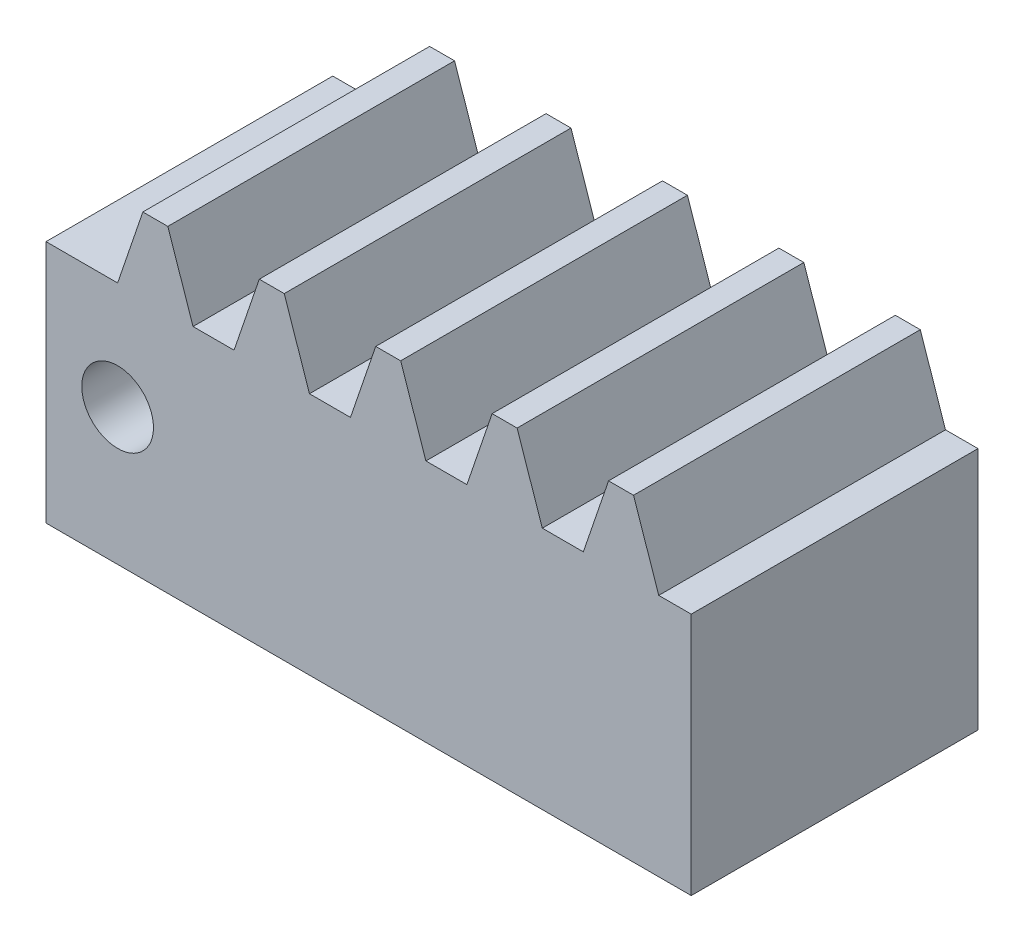
ISO-10303-21;
HEADER;
FILE_DESCRIPTION(('STEP AP214'),'2;1');
FILE_NAME('part.step','',(''),(''),'','','');
FILE_SCHEMA(('AUTOMOTIVE_DESIGN { 1 0 10303 214 1 1 1 1 }'));
ENDSEC;
DATA;
#1=APPLICATION_CONTEXT('core data for automotive mechanical design processes');
#2=APPLICATION_PROTOCOL_DEFINITION('international standard','automotive_design',2000,#1);
#3=PRODUCT_CONTEXT('',#1,'mechanical');
#4=PRODUCT('Part','Part','',(#3));
#5=PRODUCT_RELATED_PRODUCT_CATEGORY('part','',(#4));
#6=PRODUCT_DEFINITION_FORMATION('','',#4);
#7=PRODUCT_DEFINITION_CONTEXT('part definition',#1,'design');
#8=PRODUCT_DEFINITION('design','',#6,#7);
#9=PRODUCT_DEFINITION_SHAPE('','',#8);
#10=(LENGTH_UNIT() NAMED_UNIT(*) SI_UNIT(.MILLI.,.METRE.));
#11=(NAMED_UNIT(*) PLANE_ANGLE_UNIT() SI_UNIT($,.RADIAN.));
#12=(NAMED_UNIT(*) SI_UNIT($,.STERADIAN.) SOLID_ANGLE_UNIT());
#13=UNCERTAINTY_MEASURE_WITH_UNIT(LENGTH_MEASURE(1.E-05),#10,'distance_accuracy_value','');
#14=(GEOMETRIC_REPRESENTATION_CONTEXT(3) GLOBAL_UNCERTAINTY_ASSIGNED_CONTEXT((#13)) GLOBAL_UNIT_ASSIGNED_CONTEXT((#10,
#11,#12)) REPRESENTATION_CONTEXT('',''));
#15=CARTESIAN_POINT('',(0.,0.,0.));
#16=DIRECTION('',(0.,0.,1.));
#17=DIRECTION('',(1.,0.,0.));
#18=AXIS2_PLACEMENT_3D('',#15,#16,#17);
#19=CARTESIAN_POINT('',(0.,0.,25.4));
#20=DIRECTION('',(0.,1.,0.));
#21=DIRECTION('',(0.,0.,1.));
#22=AXIS2_PLACEMENT_3D('',#19,#20,#21);
#23=PLANE('',#22);
#24=DIRECTION('',(1.,0.,0.));
#25=VECTOR('',#24,1.);
#26=CARTESIAN_POINT('',(0.,0.,0.));
#27=LINE('',#26,#25);
#28=CARTESIAN_POINT('',(6.35,0.,0.));
#29=VERTEX_POINT('',#28);
#30=CARTESIAN_POINT('',(63.5,0.,0.));
#31=VERTEX_POINT('',#30);
#32=EDGE_CURVE('E274',#29,#31,#27,.T.);
#33=ORIENTED_EDGE('',*,*,#32,.T.);
#34=DIRECTION('',(0.,0.,-1.));
#35=VECTOR('',#34,1.);
#36=CARTESIAN_POINT('',(63.5,0.,25.4));
#37=LINE('',#36,#35);
#38=CARTESIAN_POINT('',(63.5,0.,25.4));
#39=VERTEX_POINT('',#38);
#40=EDGE_CURVE('E11',#39,#31,#37,.T.);
#41=ORIENTED_EDGE('',*,*,#40,.F.);
#42=DIRECTION('',(1.,0.,0.));
#43=VECTOR('',#42,1.);
#44=CARTESIAN_POINT('',(0.,0.,25.4));
#45=LINE('',#44,#43);
#46=CARTESIAN_POINT('',(6.35,0.,25.4));
#47=VERTEX_POINT('',#46);
#48=EDGE_CURVE('E240',#47,#39,#45,.T.);
#49=ORIENTED_EDGE('',*,*,#48,.F.);
#50=DIRECTION('',(0.,0.,-1.));
#51=VECTOR('',#50,1.);
#52=CARTESIAN_POINT('',(6.35,0.,25.4));
#53=LINE('',#52,#51);
#54=EDGE_CURVE('E228',#47,#29,#53,.T.);
#55=ORIENTED_EDGE('',*,*,#54,.T.);
#56=EDGE_LOOP('',(#33,#41,#49,#55));
#57=FACE_BOUND('',#56,.T.);
#58=ADVANCED_FACE('F37',(#57),#23,.F.);
#59=CARTESIAN_POINT('',(63.5,0.,25.4));
#60=DIRECTION('',(-1.,0.,0.));
#61=DIRECTION('',(0.,0.,1.));
#62=AXIS2_PLACEMENT_3D('',#59,#60,#61);
#63=PLANE('',#62);
#64=DIRECTION('',(0.,1.,0.));
#65=VECTOR('',#64,1.);
#66=CARTESIAN_POINT('',(63.5,0.,0.));
#67=LINE('',#66,#65);
#68=CARTESIAN_POINT('',(63.5,21.59,0.));
#69=VERTEX_POINT('',#68);
#70=EDGE_CURVE('E277',#31,#69,#67,.T.);
#71=ORIENTED_EDGE('',*,*,#70,.T.);
#72=DIRECTION('',(0.,0.,-1.));
#73=VECTOR('',#72,1.);
#74=CARTESIAN_POINT('',(63.5,21.59,25.4));
#75=LINE('',#74,#73);
#76=CARTESIAN_POINT('',(63.5,21.59,25.4));
#77=VERTEX_POINT('',#76);
#78=EDGE_CURVE('E46',#77,#69,#75,.T.);
#79=ORIENTED_EDGE('',*,*,#78,.F.);
#80=DIRECTION('',(0.,1.,0.));
#81=VECTOR('',#80,1.);
#82=CARTESIAN_POINT('',(63.5,0.,25.4));
#83=LINE('',#82,#81);
#84=EDGE_CURVE('E145',#39,#77,#83,.T.);
#85=ORIENTED_EDGE('',*,*,#84,.F.);
#86=ORIENTED_EDGE('',*,*,#40,.T.);
#87=EDGE_LOOP('',(#71,#79,#85,#86));
#88=FACE_BOUND('',#87,.T.);
#89=ADVANCED_FACE('F470',(#88),#63,.F.);
#90=CARTESIAN_POINT('',(0.,21.59,25.4));
#91=DIRECTION('',(0.,-1.,0.));
#92=DIRECTION('',(0.,0.,-1.));
#93=AXIS2_PLACEMENT_3D('',#90,#91,#92);
#94=PLANE('',#93);
#95=DIRECTION('',(-1.,0.,0.));
#96=VECTOR('',#95,1.);
#97=CARTESIAN_POINT('',(0.,21.59,0.));
#98=LINE('',#97,#96);
#99=CARTESIAN_POINT('',(60.6232101286471,21.59,0.));
#100=VERTEX_POINT('',#99);
#101=EDGE_CURVE('E279',#69,#100,#98,.T.);
#102=ORIENTED_EDGE('',*,*,#101,.T.);
#103=DIRECTION('',(0.,0.,-1.));
#104=VECTOR('',#103,1.);
#105=CARTESIAN_POINT('',(60.6232101286471,21.59,25.4));
#106=LINE('',#105,#104);
#107=CARTESIAN_POINT('',(60.6232101286471,21.59,25.4));
#108=VERTEX_POINT('',#107);
#109=EDGE_CURVE('E370',#108,#100,#106,.T.);
#110=ORIENTED_EDGE('',*,*,#109,.F.);
#111=DIRECTION('',(-1.,0.,0.));
#112=VECTOR('',#111,1.);
#113=CARTESIAN_POINT('',(0.,21.59,25.4));
#114=LINE('',#113,#112);
#115=EDGE_CURVE('E227',#77,#108,#114,.T.);
#116=ORIENTED_EDGE('',*,*,#115,.F.);
#117=ORIENTED_EDGE('',*,*,#78,.T.);
#118=EDGE_LOOP('',(#102,#110,#116,#117));
#119=FACE_BOUND('',#118,.T.);
#120=ADVANCED_FACE('F375',(#119),#94,.F.);
#121=CARTESIAN_POINT('',(60.9123049435169,20.7409837863864,25.4));
#122=DIRECTION('',(-0.946626767394288,-0.322331759609009,0.));
#123=DIRECTION('',(0.322331759609009,-0.946626767394288,0.));
#124=AXIS2_PLACEMENT_3D('',#121,#122,#123);
#125=PLANE('',#124);
#126=DIRECTION('',(-0.322331759609009,0.946626767394288,0.));
#127=VECTOR('',#126,1.);
#128=CARTESIAN_POINT('',(60.9123049435169,20.7409837863864,0.));
#129=LINE('',#128,#127);
#130=CARTESIAN_POINT('',(58.3880101286471,28.1543551632837,0.));
#131=VERTEX_POINT('',#130);
#132=EDGE_CURVE('E281',#100,#131,#129,.T.);
#133=ORIENTED_EDGE('',*,*,#132,.T.);
#134=DIRECTION('',(0.,0.,-1.));
#135=VECTOR('',#134,1.);
#136=CARTESIAN_POINT('',(58.3880101286471,28.1543551632837,25.4));
#137=LINE('',#136,#135);
#138=CARTESIAN_POINT('',(58.3880101286471,28.1543551632837,25.4));
#139=VERTEX_POINT('',#138);
#140=EDGE_CURVE('E367',#139,#131,#137,.T.);
#141=ORIENTED_EDGE('',*,*,#140,.F.);
#142=DIRECTION('',(-0.322331759609009,0.946626767394288,0.));
#143=VECTOR('',#142,1.);
#144=CARTESIAN_POINT('',(60.9123049435169,20.7409837863864,25.4));
#145=LINE('',#144,#143);
#146=EDGE_CURVE('E235',#108,#139,#145,.T.);
#147=ORIENTED_EDGE('',*,*,#146,.F.);
#148=ORIENTED_EDGE('',*,*,#109,.T.);
#149=EDGE_LOOP('',(#133,#141,#147,#148));
#150=FACE_BOUND('',#149,.T.);
#151=ADVANCED_FACE('F384',(#150),#125,.F.);
#152=CARTESIAN_POINT('',(0.,28.1543551632837,25.4));
#153=DIRECTION('',(0.,-1.,0.));
#154=DIRECTION('',(0.,0.,-1.));
#155=AXIS2_PLACEMENT_3D('',#152,#153,#154);
#156=PLANE('',#155);
#157=DIRECTION('',(-1.,0.,0.));
#158=VECTOR('',#157,1.);
#159=CARTESIAN_POINT('',(0.,28.1543551632837,0.));
#160=LINE('',#159,#158);
#161=CARTESIAN_POINT('',(56.1782101286471,28.1543551632837,0.));
#162=VERTEX_POINT('',#161);
#163=EDGE_CURVE('E284',#131,#162,#160,.T.);
#164=ORIENTED_EDGE('',*,*,#163,.T.);
#165=DIRECTION('',(0.,0.,-1.));
#166=VECTOR('',#165,1.);
#167=CARTESIAN_POINT('',(56.1782101286471,28.1543551632837,25.4));
#168=LINE('',#167,#166);
#169=CARTESIAN_POINT('',(56.1782101286471,28.1543551632837,25.4));
#170=VERTEX_POINT('',#169);
#171=EDGE_CURVE('E364',#170,#162,#168,.T.);
#172=ORIENTED_EDGE('',*,*,#171,.F.);
#173=DIRECTION('',(-1.,0.,0.));
#174=VECTOR('',#173,1.);
#175=CARTESIAN_POINT('',(0.,28.1543551632837,25.4));
#176=LINE('',#175,#174);
#177=EDGE_CURVE('E239',#139,#170,#176,.T.);
#178=ORIENTED_EDGE('',*,*,#177,.F.);
#179=ORIENTED_EDGE('',*,*,#140,.T.);
#180=EDGE_LOOP('',(#164,#172,#178,#179));
#181=FACE_BOUND('',#180,.T.);
#182=ADVANCED_FACE('F388',(#181),#156,.F.);
#183=CARTESIAN_POINT('',(41.7507412847351,-14.2163631610935,25.4));
#184=DIRECTION('',(0.946626767394288,-0.322331759609009,0.));
#185=DIRECTION('',(0.322331759609009,0.946626767394288,0.));
#186=AXIS2_PLACEMENT_3D('',#183,#184,#185);
#187=PLANE('',#186);
#188=DIRECTION('',(-0.322331759609009,-0.946626767394288,0.));
#189=VECTOR('',#188,1.);
#190=CARTESIAN_POINT('',(41.7507412847351,-14.2163631610935,0.));
#191=LINE('',#190,#189);
#192=CARTESIAN_POINT('',(53.9430101286471,21.59,0.));
#193=VERTEX_POINT('',#192);
#194=EDGE_CURVE('E286',#162,#193,#191,.T.);
#195=ORIENTED_EDGE('',*,*,#194,.T.);
#196=DIRECTION('',(0.,0.,-1.));
#197=VECTOR('',#196,1.);
#198=CARTESIAN_POINT('',(53.9430101286471,21.59,25.4));
#199=LINE('',#198,#197);
#200=CARTESIAN_POINT('',(53.9430101286471,21.59,25.4));
#201=VERTEX_POINT('',#200);
#202=EDGE_CURVE('E361',#201,#193,#199,.T.);
#203=ORIENTED_EDGE('',*,*,#202,.F.);
#204=DIRECTION('',(-0.322331759609009,-0.946626767394288,0.));
#205=VECTOR('',#204,1.);
#206=CARTESIAN_POINT('',(41.7507412847351,-14.2163631610935,25.4));
#207=LINE('',#206,#205);
#208=EDGE_CURVE('E242',#170,#201,#207,.T.);
#209=ORIENTED_EDGE('',*,*,#208,.F.);
#210=ORIENTED_EDGE('',*,*,#171,.T.);
#211=EDGE_LOOP('',(#195,#203,#209,#210));
#212=FACE_BOUND('',#211,.T.);
#213=ADVANCED_FACE('F466',(#212),#187,.F.);
#214=CARTESIAN_POINT('',(50.3108101286471,21.59,0.));
#215=VERTEX_POINT('',#214);
#216=EDGE_CURVE('E282',#193,#215,#98,.T.);
#217=ORIENTED_EDGE('',*,*,#216,.T.);
#218=DIRECTION('',(0.,0.,-1.));
#219=VECTOR('',#218,1.);
#220=CARTESIAN_POINT('',(50.3108101286471,21.59,25.4));
#221=LINE('',#220,#219);
#222=CARTESIAN_POINT('',(50.3108101286471,21.59,25.4));
#223=VERTEX_POINT('',#222);
#224=EDGE_CURVE('E358',#223,#215,#221,.T.);
#225=ORIENTED_EDGE('',*,*,#224,.F.);
#226=EDGE_CURVE('E236',#201,#223,#114,.T.);
#227=ORIENTED_EDGE('',*,*,#226,.F.);
#228=ORIENTED_EDGE('',*,*,#202,.T.);
#229=EDGE_LOOP('',(#217,#225,#227,#228));
#230=FACE_BOUND('',#229,.T.);
#231=ADVANCED_FACE('F454',(#230),#94,.F.);
#232=CARTESIAN_POINT('',(51.6713402372834,17.5943831230182,25.4));
#233=DIRECTION('',(-0.946626767394288,-0.322331759609009,0.));
#234=DIRECTION('',(0.322331759609009,-0.946626767394288,0.));
#235=AXIS2_PLACEMENT_3D('',#232,#233,#234);
#236=PLANE('',#235);
#237=DIRECTION('',(-0.322331759609009,0.946626767394288,0.));
#238=VECTOR('',#237,1.);
#239=CARTESIAN_POINT('',(51.6713402372834,17.5943831230182,0.));
#240=LINE('',#239,#238);
#241=CARTESIAN_POINT('',(48.0756101286471,28.1543551632837,0.));
#242=VERTEX_POINT('',#241);
#243=EDGE_CURVE('E288',#215,#242,#240,.T.);
#244=ORIENTED_EDGE('',*,*,#243,.T.);
#245=DIRECTION('',(0.,0.,-1.));
#246=VECTOR('',#245,1.);
#247=CARTESIAN_POINT('',(48.0756101286471,28.1543551632837,25.4));
#248=LINE('',#247,#246);
#249=CARTESIAN_POINT('',(48.0756101286471,28.1543551632837,25.4));
#250=VERTEX_POINT('',#249);
#251=EDGE_CURVE('E355',#250,#242,#248,.T.);
#252=ORIENTED_EDGE('',*,*,#251,.F.);
#253=DIRECTION('',(-0.322331759609009,0.946626767394288,0.));
#254=VECTOR('',#253,1.);
#255=CARTESIAN_POINT('',(51.6713402372834,17.5943831230182,25.4));
#256=LINE('',#255,#254);
#257=EDGE_CURVE('E241',#223,#250,#256,.T.);
#258=ORIENTED_EDGE('',*,*,#257,.F.);
#259=ORIENTED_EDGE('',*,*,#224,.T.);
#260=EDGE_LOOP('',(#244,#252,#258,#259));
#261=FACE_BOUND('',#260,.T.);
#262=ADVANCED_FACE('F458',(#261),#236,.F.);
#263=CARTESIAN_POINT('',(0.,28.1543551632837,25.4));
#264=DIRECTION('',(0.,-1.,0.));
#265=DIRECTION('',(0.,0.,-1.));
#266=AXIS2_PLACEMENT_3D('',#263,#264,#265);
#267=PLANE('',#266);
#268=DIRECTION('',(-1.,0.,0.));
#269=VECTOR('',#268,1.);
#270=CARTESIAN_POINT('',(0.,28.1543551632837,0.));
#271=LINE('',#270,#269);
#272=CARTESIAN_POINT('',(45.8658101286471,28.1543551632837,0.));
#273=VERTEX_POINT('',#272);
#274=EDGE_CURVE('E290',#242,#273,#271,.T.);
#275=ORIENTED_EDGE('',*,*,#274,.T.);
#276=DIRECTION('',(0.,0.,-1.));
#277=VECTOR('',#276,1.);
#278=CARTESIAN_POINT('',(45.8658101286471,28.1543551632837,25.4));
#279=LINE('',#278,#277);
#280=CARTESIAN_POINT('',(45.8658101286471,28.1543551632837,25.4));
#281=VERTEX_POINT('',#280);
#282=EDGE_CURVE('E352',#281,#273,#279,.T.);
#283=ORIENTED_EDGE('',*,*,#282,.F.);
#284=DIRECTION('',(-1.,0.,0.));
#285=VECTOR('',#284,1.);
#286=CARTESIAN_POINT('',(0.,28.1543551632837,25.4));
#287=LINE('',#286,#285);
#288=EDGE_CURVE('E246',#250,#281,#287,.T.);
#289=ORIENTED_EDGE('',*,*,#288,.F.);
#290=ORIENTED_EDGE('',*,*,#251,.T.);
#291=EDGE_LOOP('',(#275,#283,#289,#290));
#292=FACE_BOUND('',#291,.T.);
#293=ADVANCED_FACE('F400',(#292),#267,.F.);
#294=CARTESIAN_POINT('',(32.5097765785017,-11.0697624977253,25.4));
#295=DIRECTION('',(0.946626767394288,-0.322331759609009,0.));
#296=DIRECTION('',(0.322331759609009,0.946626767394288,0.));
#297=AXIS2_PLACEMENT_3D('',#294,#295,#296);
#298=PLANE('',#297);
#299=DIRECTION('',(-0.322331759609009,-0.946626767394288,0.));
#300=VECTOR('',#299,1.);
#301=CARTESIAN_POINT('',(32.5097765785017,-11.0697624977253,0.));
#302=LINE('',#301,#300);
#303=CARTESIAN_POINT('',(43.6306101286471,21.59,0.));
#304=VERTEX_POINT('',#303);
#305=EDGE_CURVE('E292',#273,#304,#302,.T.);
#306=ORIENTED_EDGE('',*,*,#305,.T.);
#307=DIRECTION('',(0.,0.,-1.));
#308=VECTOR('',#307,1.);
#309=CARTESIAN_POINT('',(43.6306101286471,21.59,25.4));
#310=LINE('',#309,#308);
#311=CARTESIAN_POINT('',(43.6306101286471,21.59,25.4));
#312=VERTEX_POINT('',#311);
#313=EDGE_CURVE('E349',#312,#304,#310,.T.);
#314=ORIENTED_EDGE('',*,*,#313,.F.);
#315=DIRECTION('',(-0.322331759609009,-0.946626767394288,0.));
#316=VECTOR('',#315,1.);
#317=CARTESIAN_POINT('',(32.5097765785017,-11.0697624977253,25.4));
#318=LINE('',#317,#316);
#319=EDGE_CURVE('E250',#281,#312,#318,.T.);
#320=ORIENTED_EDGE('',*,*,#319,.F.);
#321=ORIENTED_EDGE('',*,*,#282,.T.);
#322=EDGE_LOOP('',(#306,#314,#320,#321));
#323=FACE_BOUND('',#322,.T.);
#324=ADVANCED_FACE('F404',(#323),#298,.F.);
#325=CARTESIAN_POINT('',(39.9984101286471,21.59,0.));
#326=VERTEX_POINT('',#325);
#327=EDGE_CURVE('E294',#304,#326,#98,.T.);
#328=ORIENTED_EDGE('',*,*,#327,.T.);
#329=DIRECTION('',(0.,0.,-1.));
#330=VECTOR('',#329,1.);
#331=CARTESIAN_POINT('',(39.9984101286471,21.59,25.4));
#332=LINE('',#331,#330);
#333=CARTESIAN_POINT('',(39.9984101286471,21.59,25.4));
#334=VERTEX_POINT('',#333);
#335=EDGE_CURVE('E346',#334,#326,#332,.T.);
#336=ORIENTED_EDGE('',*,*,#335,.F.);
#337=EDGE_CURVE('E243',#312,#334,#114,.T.);
#338=ORIENTED_EDGE('',*,*,#337,.F.);
#339=ORIENTED_EDGE('',*,*,#313,.T.);
#340=EDGE_LOOP('',(#328,#336,#338,#339));
#341=FACE_BOUND('',#340,.T.);
#342=ADVANCED_FACE('F407',(#341),#94,.F.);
#343=CARTESIAN_POINT('',(42.4303755310499,14.4477824596499,25.4));
#344=DIRECTION('',(-0.946626767394289,-0.322331759609008,0.));
#345=DIRECTION('',(0.322331759609008,-0.946626767394289,0.));
#346=AXIS2_PLACEMENT_3D('',#343,#344,#345);
#347=PLANE('',#346);
#348=DIRECTION('',(-0.322331759609008,0.946626767394289,0.));
#349=VECTOR('',#348,1.);
#350=CARTESIAN_POINT('',(42.4303755310499,14.4477824596499,0.));
#351=LINE('',#350,#349);
#352=CARTESIAN_POINT('',(37.7632101286471,28.1543551632837,0.));
#353=VERTEX_POINT('',#352);
#354=EDGE_CURVE('E295',#326,#353,#351,.T.);
#355=ORIENTED_EDGE('',*,*,#354,.T.);
#356=DIRECTION('',(0.,0.,-1.));
#357=VECTOR('',#356,1.);
#358=CARTESIAN_POINT('',(37.7632101286471,28.1543551632837,25.4));
#359=LINE('',#358,#357);
#360=CARTESIAN_POINT('',(37.7632101286471,28.1543551632837,25.4));
#361=VERTEX_POINT('',#360);
#362=EDGE_CURVE('E343',#361,#353,#359,.T.);
#363=ORIENTED_EDGE('',*,*,#362,.F.);
#364=DIRECTION('',(-0.322331759609008,0.946626767394289,0.));
#365=VECTOR('',#364,1.);
#366=CARTESIAN_POINT('',(42.4303755310499,14.4477824596499,25.4));
#367=LINE('',#366,#365);
#368=EDGE_CURVE('E249',#334,#361,#367,.T.);
#369=ORIENTED_EDGE('',*,*,#368,.F.);
#370=ORIENTED_EDGE('',*,*,#335,.T.);
#371=EDGE_LOOP('',(#355,#363,#369,#370));
#372=FACE_BOUND('',#371,.T.);
#373=ADVANCED_FACE('F412',(#372),#347,.F.);
#374=CARTESIAN_POINT('',(0.,28.1543551632837,25.4));
#375=DIRECTION('',(0.,-1.,0.));
#376=DIRECTION('',(0.,0.,-1.));
#377=AXIS2_PLACEMENT_3D('',#374,#375,#376);
#378=PLANE('',#377);
#379=DIRECTION('',(-1.,0.,0.));
#380=VECTOR('',#379,1.);
#381=CARTESIAN_POINT('',(0.,28.1543551632837,0.));
#382=LINE('',#381,#380);
#383=CARTESIAN_POINT('',(35.5534101286471,28.1543551632837,0.));
#384=VERTEX_POINT('',#383);
#385=EDGE_CURVE('E297',#353,#384,#382,.T.);
#386=ORIENTED_EDGE('',*,*,#385,.T.);
#387=DIRECTION('',(0.,0.,-1.));
#388=VECTOR('',#387,1.);
#389=CARTESIAN_POINT('',(35.5534101286471,28.1543551632837,25.4));
#390=LINE('',#389,#388);
#391=CARTESIAN_POINT('',(35.5534101286471,28.1543551632837,25.4));
#392=VERTEX_POINT('',#391);
#393=EDGE_CURVE('E340',#392,#384,#390,.T.);
#394=ORIENTED_EDGE('',*,*,#393,.F.);
#395=DIRECTION('',(-1.,0.,0.));
#396=VECTOR('',#395,1.);
#397=CARTESIAN_POINT('',(0.,28.1543551632837,25.4));
#398=LINE('',#397,#396);
#399=EDGE_CURVE('E253',#361,#392,#398,.T.);
#400=ORIENTED_EDGE('',*,*,#399,.F.);
#401=ORIENTED_EDGE('',*,*,#362,.T.);
#402=EDGE_LOOP('',(#386,#394,#400,#401));
#403=FACE_BOUND('',#402,.T.);
#404=ADVANCED_FACE('F416',(#403),#378,.F.);
#405=CARTESIAN_POINT('',(23.2688118722682,-7.92316183435702,25.4));
#406=DIRECTION('',(0.946626767394289,-0.322331759609008,0.));
#407=DIRECTION('',(0.322331759609008,0.946626767394289,0.));
#408=AXIS2_PLACEMENT_3D('',#405,#406,#407);
#409=PLANE('',#408);
#410=DIRECTION('',(-0.322331759609008,-0.946626767394289,0.));
#411=VECTOR('',#410,1.);
#412=CARTESIAN_POINT('',(23.2688118722682,-7.92316183435702,0.));
#413=LINE('',#412,#411);
#414=CARTESIAN_POINT('',(33.3182101286471,21.59,0.));
#415=VERTEX_POINT('',#414);
#416=EDGE_CURVE('E299',#384,#415,#413,.T.);
#417=ORIENTED_EDGE('',*,*,#416,.T.);
#418=DIRECTION('',(0.,0.,-1.));
#419=VECTOR('',#418,1.);
#420=CARTESIAN_POINT('',(33.3182101286471,21.59,25.4));
#421=LINE('',#420,#419);
#422=CARTESIAN_POINT('',(33.3182101286471,21.59,25.4));
#423=VERTEX_POINT('',#422);
#424=EDGE_CURVE('E337',#423,#415,#421,.T.);
#425=ORIENTED_EDGE('',*,*,#424,.F.);
#426=DIRECTION('',(-0.322331759609008,-0.946626767394289,0.));
#427=VECTOR('',#426,1.);
#428=CARTESIAN_POINT('',(23.2688118722682,-7.92316183435702,25.4));
#429=LINE('',#428,#427);
#430=EDGE_CURVE('E257',#392,#423,#429,.T.);
#431=ORIENTED_EDGE('',*,*,#430,.F.);
#432=ORIENTED_EDGE('',*,*,#393,.T.);
#433=EDGE_LOOP('',(#417,#425,#431,#432));
#434=FACE_BOUND('',#433,.T.);
#435=ADVANCED_FACE('F420',(#434),#409,.F.);
#436=CARTESIAN_POINT('',(29.6860101286471,21.59,0.));
#437=VERTEX_POINT('',#436);
#438=EDGE_CURVE('E301',#415,#437,#98,.T.);
#439=ORIENTED_EDGE('',*,*,#438,.T.);
#440=DIRECTION('',(0.,0.,-1.));
#441=VECTOR('',#440,1.);
#442=CARTESIAN_POINT('',(29.6860101286471,21.59,25.4));
#443=LINE('',#442,#441);
#444=CARTESIAN_POINT('',(29.6860101286471,21.59,25.4));
#445=VERTEX_POINT('',#444);
#446=EDGE_CURVE('E334',#445,#437,#443,.T.);
#447=ORIENTED_EDGE('',*,*,#446,.F.);
#448=EDGE_CURVE('E234',#423,#445,#114,.T.);
#449=ORIENTED_EDGE('',*,*,#448,.F.);
#450=ORIENTED_EDGE('',*,*,#424,.T.);
#451=EDGE_LOOP('',(#439,#447,#449,#450));
#452=FACE_BOUND('',#451,.T.);
#453=ADVANCED_FACE('F423',(#452),#94,.F.);
#454=CARTESIAN_POINT('',(33.1894108248164,11.3011817962817,25.4));
#455=DIRECTION('',(-0.946626767394289,-0.322331759609008,0.));
#456=DIRECTION('',(0.322331759609008,-0.946626767394289,0.));
#457=AXIS2_PLACEMENT_3D('',#454,#455,#456);
#458=PLANE('',#457);
#459=DIRECTION('',(-0.322331759609008,0.946626767394289,0.));
#460=VECTOR('',#459,1.);
#461=CARTESIAN_POINT('',(33.1894108248164,11.3011817962817,0.));
#462=LINE('',#461,#460);
#463=CARTESIAN_POINT('',(27.4508101286471,28.1543551632837,0.));
#464=VERTEX_POINT('',#463);
#465=EDGE_CURVE('E302',#437,#464,#462,.T.);
#466=ORIENTED_EDGE('',*,*,#465,.T.);
#467=DIRECTION('',(0.,0.,-1.));
#468=VECTOR('',#467,1.);
#469=CARTESIAN_POINT('',(27.4508101286471,28.1543551632837,25.4));
#470=LINE('',#469,#468);
#471=CARTESIAN_POINT('',(27.4508101286471,28.1543551632837,25.4));
#472=VERTEX_POINT('',#471);
#473=EDGE_CURVE('E331',#472,#464,#470,.T.);
#474=ORIENTED_EDGE('',*,*,#473,.F.);
#475=DIRECTION('',(-0.322331759609008,0.946626767394289,0.));
#476=VECTOR('',#475,1.);
#477=CARTESIAN_POINT('',(33.1894108248164,11.3011817962817,25.4));
#478=LINE('',#477,#476);
#479=EDGE_CURVE('E256',#445,#472,#478,.T.);
#480=ORIENTED_EDGE('',*,*,#479,.F.);
#481=ORIENTED_EDGE('',*,*,#446,.T.);
#482=EDGE_LOOP('',(#466,#474,#480,#481));
#483=FACE_BOUND('',#482,.T.);
#484=ADVANCED_FACE('F428',(#483),#458,.F.);
#485=CARTESIAN_POINT('',(0.,28.1543551632837,25.4));
#486=DIRECTION('',(0.,-1.,0.));
#487=DIRECTION('',(0.,0.,-1.));
#488=AXIS2_PLACEMENT_3D('',#485,#486,#487);
#489=PLANE('',#488);
#490=DIRECTION('',(-1.,0.,0.));
#491=VECTOR('',#490,1.);
#492=CARTESIAN_POINT('',(0.,28.1543551632837,0.));
#493=LINE('',#492,#491);
#494=CARTESIAN_POINT('',(25.2410101286471,28.1543551632837,0.));
#495=VERTEX_POINT('',#494);
#496=EDGE_CURVE('E304',#464,#495,#493,.T.);
#497=ORIENTED_EDGE('',*,*,#496,.T.);
#498=DIRECTION('',(0.,0.,-1.));
#499=VECTOR('',#498,1.);
#500=CARTESIAN_POINT('',(25.2410101286471,28.1543551632837,25.4));
#501=LINE('',#500,#499);
#502=CARTESIAN_POINT('',(25.2410101286471,28.1543551632837,25.4));
#503=VERTEX_POINT('',#502);
#504=EDGE_CURVE('E328',#503,#495,#501,.T.);
#505=ORIENTED_EDGE('',*,*,#504,.F.);
#506=DIRECTION('',(-1.,0.,0.));
#507=VECTOR('',#506,1.);
#508=CARTESIAN_POINT('',(0.,28.1543551632837,25.4));
#509=LINE('',#508,#507);
#510=EDGE_CURVE('E260',#472,#503,#509,.T.);
#511=ORIENTED_EDGE('',*,*,#510,.F.);
#512=ORIENTED_EDGE('',*,*,#473,.T.);
#513=EDGE_LOOP('',(#497,#505,#511,#512));
#514=FACE_BOUND('',#513,.T.);
#515=ADVANCED_FACE('F434',(#514),#489,.F.);
#516=CARTESIAN_POINT('',(14.0278471660347,-4.77656117098881,25.4));
#517=DIRECTION('',(0.946626767394289,-0.322331759609008,0.));
#518=DIRECTION('',(0.322331759609008,0.946626767394289,0.));
#519=AXIS2_PLACEMENT_3D('',#516,#517,#518);
#520=PLANE('',#519);
#521=DIRECTION('',(-0.322331759609008,-0.946626767394289,0.));
#522=VECTOR('',#521,1.);
#523=CARTESIAN_POINT('',(14.0278471660347,-4.77656117098881,0.));
#524=LINE('',#523,#522);
#525=CARTESIAN_POINT('',(23.0058101286471,21.59,0.));
#526=VERTEX_POINT('',#525);
#527=EDGE_CURVE('E306',#495,#526,#524,.T.);
#528=ORIENTED_EDGE('',*,*,#527,.T.);
#529=DIRECTION('',(0.,0.,-1.));
#530=VECTOR('',#529,1.);
#531=CARTESIAN_POINT('',(23.0058101286471,21.59,25.4));
#532=LINE('',#531,#530);
#533=CARTESIAN_POINT('',(23.0058101286471,21.59,25.4));
#534=VERTEX_POINT('',#533);
#535=EDGE_CURVE('E325',#534,#526,#532,.T.);
#536=ORIENTED_EDGE('',*,*,#535,.F.);
#537=DIRECTION('',(-0.322331759609008,-0.946626767394289,0.));
#538=VECTOR('',#537,1.);
#539=CARTESIAN_POINT('',(14.0278471660347,-4.77656117098881,25.4));
#540=LINE('',#539,#538);
#541=EDGE_CURVE('E233',#503,#534,#540,.T.);
#542=ORIENTED_EDGE('',*,*,#541,.F.);
#543=ORIENTED_EDGE('',*,*,#504,.T.);
#544=EDGE_LOOP('',(#528,#536,#542,#543));
#545=FACE_BOUND('',#544,.T.);
#546=ADVANCED_FACE('F438',(#545),#520,.F.);
#547=CARTESIAN_POINT('',(19.3736101286471,21.59,0.));
#548=VERTEX_POINT('',#547);
#549=EDGE_CURVE('E308',#526,#548,#98,.T.);
#550=ORIENTED_EDGE('',*,*,#549,.T.);
#551=DIRECTION('',(0.,0.,-1.));
#552=VECTOR('',#551,1.);
#553=CARTESIAN_POINT('',(19.3736101286471,21.59,25.4));
#554=LINE('',#553,#552);
#555=CARTESIAN_POINT('',(19.3736101286471,21.59,25.4));
#556=VERTEX_POINT('',#555);
#557=EDGE_CURVE('E322',#556,#548,#554,.T.);
#558=ORIENTED_EDGE('',*,*,#557,.F.);
#559=EDGE_CURVE('E226',#534,#556,#114,.T.);
#560=ORIENTED_EDGE('',*,*,#559,.F.);
#561=ORIENTED_EDGE('',*,*,#535,.T.);
#562=EDGE_LOOP('',(#550,#558,#560,#561));
#563=FACE_BOUND('',#562,.T.);
#564=ADVANCED_FACE('F443',(#563),#94,.F.);
#565=CARTESIAN_POINT('',(23.9484461185829,8.15458113291352,25.4));
#566=DIRECTION('',(-0.946626767394288,-0.322331759609009,0.));
#567=DIRECTION('',(0.322331759609009,-0.946626767394288,0.));
#568=AXIS2_PLACEMENT_3D('',#565,#566,#567);
#569=PLANE('',#568);
#570=DIRECTION('',(-0.322331759609009,0.946626767394288,0.));
#571=VECTOR('',#570,1.);
#572=CARTESIAN_POINT('',(23.9484461185829,8.15458113291352,0.));
#573=LINE('',#572,#571);
#574=CARTESIAN_POINT('',(17.1384101286471,28.1543551632837,0.));
#575=VERTEX_POINT('',#574);
#576=EDGE_CURVE('E309',#548,#575,#573,.T.);
#577=ORIENTED_EDGE('',*,*,#576,.T.);
#578=DIRECTION('',(0.,0.,-1.));
#579=VECTOR('',#578,1.);
#580=CARTESIAN_POINT('',(17.1384101286471,28.1543551632837,25.4));
#581=LINE('',#580,#579);
#582=CARTESIAN_POINT('',(17.1384101286471,28.1543551632837,25.4));
#583=VERTEX_POINT('',#582);
#584=EDGE_CURVE('E319',#583,#575,#581,.T.);
#585=ORIENTED_EDGE('',*,*,#584,.F.);
#586=DIRECTION('',(-0.322331759609009,0.946626767394288,0.));
#587=VECTOR('',#586,1.);
#588=CARTESIAN_POINT('',(23.9484461185829,8.15458113291352,25.4));
#589=LINE('',#588,#587);
#590=EDGE_CURVE('E232',#556,#583,#589,.T.);
#591=ORIENTED_EDGE('',*,*,#590,.F.);
#592=ORIENTED_EDGE('',*,*,#557,.T.);
#593=EDGE_LOOP('',(#577,#585,#591,#592));
#594=FACE_BOUND('',#593,.T.);
#595=ADVANCED_FACE('F447',(#594),#569,.F.);
#596=CARTESIAN_POINT('',(0.,28.1543551632837,25.4));
#597=DIRECTION('',(0.,-1.,0.));
#598=DIRECTION('',(0.,0.,-1.));
#599=AXIS2_PLACEMENT_3D('',#596,#597,#598);
#600=PLANE('',#599);
#601=DIRECTION('',(-1.,0.,0.));
#602=VECTOR('',#601,1.);
#603=CARTESIAN_POINT('',(0.,28.1543551632837,0.));
#604=LINE('',#603,#602);
#605=CARTESIAN_POINT('',(14.9286101286471,28.1543551632837,0.));
#606=VERTEX_POINT('',#605);
#607=EDGE_CURVE('E311',#575,#606,#604,.T.);
#608=ORIENTED_EDGE('',*,*,#607,.T.);
#609=DIRECTION('',(0.,0.,-1.));
#610=VECTOR('',#609,1.);
#611=CARTESIAN_POINT('',(14.9286101286471,28.1543551632837,25.4));
#612=LINE('',#611,#610);
#613=CARTESIAN_POINT('',(14.9286101286471,28.1543551632837,25.4));
#614=VERTEX_POINT('',#613);
#615=EDGE_CURVE('E221',#614,#606,#612,.T.);
#616=ORIENTED_EDGE('',*,*,#615,.F.);
#617=DIRECTION('',(-1.,0.,0.));
#618=VECTOR('',#617,1.);
#619=CARTESIAN_POINT('',(0.,28.1543551632837,25.4));
#620=LINE('',#619,#618);
#621=EDGE_CURVE('E212',#583,#614,#620,.T.);
#622=ORIENTED_EDGE('',*,*,#621,.F.);
#623=ORIENTED_EDGE('',*,*,#584,.T.);
#624=EDGE_LOOP('',(#608,#616,#622,#623));
#625=FACE_BOUND('',#624,.T.);
#626=ADVANCED_FACE('F451',(#625),#600,.F.);
#627=CARTESIAN_POINT('',(4.7868824598012,-1.62996050762058,25.4));
#628=DIRECTION('',(0.946626767394288,-0.322331759609009,0.));
#629=DIRECTION('',(0.322331759609009,0.946626767394288,0.));
#630=AXIS2_PLACEMENT_3D('',#627,#628,#629);
#631=PLANE('',#630);
#632=DIRECTION('',(-0.322331759609009,-0.946626767394288,0.));
#633=VECTOR('',#632,1.);
#634=CARTESIAN_POINT('',(4.7868824598012,-1.62996050762058,0.));
#635=LINE('',#634,#633);
#636=CARTESIAN_POINT('',(12.6934101286471,21.59,0.));
#637=VERTEX_POINT('',#636);
#638=EDGE_CURVE('E220',#606,#637,#635,.T.);
#639=ORIENTED_EDGE('',*,*,#638,.T.);
#640=DIRECTION('',(0.,0.,-1.));
#641=VECTOR('',#640,1.);
#642=CARTESIAN_POINT('',(12.6934101286471,21.59,25.4));
#643=LINE('',#642,#641);
#644=CARTESIAN_POINT('',(12.6934101286471,21.59,25.4));
#645=VERTEX_POINT('',#644);
#646=EDGE_CURVE('E217',#645,#637,#643,.T.);
#647=ORIENTED_EDGE('',*,*,#646,.F.);
#648=DIRECTION('',(-0.322331759609009,-0.946626767394288,0.));
#649=VECTOR('',#648,1.);
#650=CARTESIAN_POINT('',(4.7868824598012,-1.62996050762058,25.4));
#651=LINE('',#650,#649);
#652=EDGE_CURVE('E206',#614,#645,#651,.T.);
#653=ORIENTED_EDGE('',*,*,#652,.F.);
#654=ORIENTED_EDGE('',*,*,#615,.T.);
#655=EDGE_LOOP('',(#639,#647,#653,#654));
#656=FACE_BOUND('',#655,.T.);
#657=ADVANCED_FACE('F218',(#656),#631,.F.);
#658=CARTESIAN_POINT('',(6.35,21.59,0.));
#659=VERTEX_POINT('',#658);
#660=EDGE_CURVE('E131',#637,#659,#98,.T.);
#661=ORIENTED_EDGE('',*,*,#660,.T.);
#662=DIRECTION('',(0.,0.,-1.));
#663=VECTOR('',#662,1.);
#664=CARTESIAN_POINT('',(6.35,21.59,25.4));
#665=LINE('',#664,#663);
#666=CARTESIAN_POINT('',(6.35,21.59,25.4));
#667=VERTEX_POINT('',#666);
#668=EDGE_CURVE('E222',#667,#659,#665,.T.);
#669=ORIENTED_EDGE('',*,*,#668,.F.);
#670=EDGE_CURVE('E210',#645,#667,#114,.T.);
#671=ORIENTED_EDGE('',*,*,#670,.F.);
#672=ORIENTED_EDGE('',*,*,#646,.T.);
#673=EDGE_LOOP('',(#661,#669,#671,#672));
#674=FACE_BOUND('',#673,.T.);
#675=ADVANCED_FACE('F224',(#674),#94,.F.);
#676=CARTESIAN_POINT('',(12.6934101286471,12.0734650732809,25.4));
#677=DIRECTION('',(0.,0.,-1.));
#678=DIRECTION('',(-1.,0.,0.));
#679=AXIS2_PLACEMENT_3D('',#676,#677,#678);
#680=CYLINDRICAL_SURFACE('',#679,3.175);
#681=CARTESIAN_POINT('',(12.6934101286471,12.0734650732809,25.4));
#682=DIRECTION('',(0.,0.,1.));
#683=DIRECTION('',(1.,0.,0.));
#684=AXIS2_PLACEMENT_3D('',#681,#682,#683);
#685=CIRCLE('',#684,3.175);
#686=CARTESIAN_POINT('',(15.8684101286471,12.0734650732809,25.4));
#687=VERTEX_POINT('',#686);
#688=EDGE_CURVE('E315',#687,#687,#685,.T.);
#689=ORIENTED_EDGE('',*,*,#688,.T.);
#690=EDGE_LOOP('',(#689));
#691=FACE_BOUND('',#690,.T.);
#692=CARTESIAN_POINT('',(12.6934101286471,12.0734650732809,0.));
#693=DIRECTION('',(0.,0.,1.));
#694=DIRECTION('',(1.,0.,0.));
#695=AXIS2_PLACEMENT_3D('',#692,#693,#694);
#696=CIRCLE('',#695,3.175);
#697=CARTESIAN_POINT('',(15.8684101286471,12.0734650732809,0.));
#698=VERTEX_POINT('',#697);
#699=EDGE_CURVE('E271',#698,#698,#696,.T.);
#700=ORIENTED_EDGE('',*,*,#699,.F.);
#701=EDGE_LOOP('',(#700));
#702=FACE_BOUND('',#701,.T.);
#703=ADVANCED_FACE('F39',(#691,#702),#680,.F.);
#704=CARTESIAN_POINT('',(6.35,0.,25.4));
#705=DIRECTION('',(1.,0.,0.));
#706=DIRECTION('',(0.,0.,-1.));
#707=AXIS2_PLACEMENT_3D('',#704,#705,#706);
#708=PLANE('',#707);
#709=DIRECTION('',(0.,-1.,0.));
#710=VECTOR('',#709,1.);
#711=CARTESIAN_POINT('',(6.35,0.,0.));
#712=LINE('',#711,#710);
#713=EDGE_CURVE('E137',#659,#29,#712,.T.);
#714=ORIENTED_EDGE('',*,*,#713,.T.);
#715=ORIENTED_EDGE('',*,*,#54,.F.);
#716=DIRECTION('',(0.,-1.,0.));
#717=VECTOR('',#716,1.);
#718=CARTESIAN_POINT('',(6.35,0.,25.4));
#719=LINE('',#718,#717);
#720=EDGE_CURVE('E54',#667,#47,#719,.T.);
#721=ORIENTED_EDGE('',*,*,#720,.F.);
#722=ORIENTED_EDGE('',*,*,#668,.T.);
#723=EDGE_LOOP('',(#714,#715,#721,#722));
#724=FACE_BOUND('',#723,.T.);
#725=ADVANCED_FACE('F630',(#724),#708,.F.);
#726=CARTESIAN_POINT('',(0.,0.,25.4));
#727=DIRECTION('',(0.,0.,1.));
#728=DIRECTION('',(1.,0.,0.));
#729=AXIS2_PLACEMENT_3D('',#726,#727,#728);
#730=PLANE('',#729);
#731=ORIENTED_EDGE('',*,*,#688,.F.);
#732=EDGE_LOOP('',(#731));
#733=FACE_BOUND('',#732,.T.);
#734=ORIENTED_EDGE('',*,*,#48,.T.);
#735=ORIENTED_EDGE('',*,*,#84,.T.);
#736=ORIENTED_EDGE('',*,*,#115,.T.);
#737=ORIENTED_EDGE('',*,*,#146,.T.);
#738=ORIENTED_EDGE('',*,*,#177,.T.);
#739=ORIENTED_EDGE('',*,*,#208,.T.);
#740=ORIENTED_EDGE('',*,*,#226,.T.);
#741=ORIENTED_EDGE('',*,*,#257,.T.);
#742=ORIENTED_EDGE('',*,*,#288,.T.);
#743=ORIENTED_EDGE('',*,*,#319,.T.);
#744=ORIENTED_EDGE('',*,*,#337,.T.);
#745=ORIENTED_EDGE('',*,*,#368,.T.);
#746=ORIENTED_EDGE('',*,*,#399,.T.);
#747=ORIENTED_EDGE('',*,*,#430,.T.);
#748=ORIENTED_EDGE('',*,*,#448,.T.);
#749=ORIENTED_EDGE('',*,*,#479,.T.);
#750=ORIENTED_EDGE('',*,*,#510,.T.);
#751=ORIENTED_EDGE('',*,*,#541,.T.);
#752=ORIENTED_EDGE('',*,*,#559,.T.);
#753=ORIENTED_EDGE('',*,*,#590,.T.);
#754=ORIENTED_EDGE('',*,*,#621,.T.);
#755=ORIENTED_EDGE('',*,*,#652,.T.);
#756=ORIENTED_EDGE('',*,*,#670,.T.);
#757=ORIENTED_EDGE('',*,*,#720,.T.);
#758=EDGE_LOOP('',(#734,#735,#736,#737,#738,#739,#740,#741,#742,#743,#744,#745,#746,#747,#748,
#749,#750,#751,#752,#753,#754,#755,#756,#757));
#759=FACE_BOUND('',#758,.T.);
#760=ADVANCED_FACE('F208',(#733,#759),#730,.T.);
#761=CARTESIAN_POINT('',(0.,0.,0.));
#762=DIRECTION('',(0.,0.,1.));
#763=DIRECTION('',(1.,0.,0.));
#764=AXIS2_PLACEMENT_3D('',#761,#762,#763);
#765=PLANE('',#764);
#766=ORIENTED_EDGE('',*,*,#699,.T.);
#767=EDGE_LOOP('',(#766));
#768=FACE_BOUND('',#767,.T.);
#769=ORIENTED_EDGE('',*,*,#32,.F.);
#770=ORIENTED_EDGE('',*,*,#713,.F.);
#771=ORIENTED_EDGE('',*,*,#660,.F.);
#772=ORIENTED_EDGE('',*,*,#638,.F.);
#773=ORIENTED_EDGE('',*,*,#607,.F.);
#774=ORIENTED_EDGE('',*,*,#576,.F.);
#775=ORIENTED_EDGE('',*,*,#549,.F.);
#776=ORIENTED_EDGE('',*,*,#527,.F.);
#777=ORIENTED_EDGE('',*,*,#496,.F.);
#778=ORIENTED_EDGE('',*,*,#465,.F.);
#779=ORIENTED_EDGE('',*,*,#438,.F.);
#780=ORIENTED_EDGE('',*,*,#416,.F.);
#781=ORIENTED_EDGE('',*,*,#385,.F.);
#782=ORIENTED_EDGE('',*,*,#354,.F.);
#783=ORIENTED_EDGE('',*,*,#327,.F.);
#784=ORIENTED_EDGE('',*,*,#305,.F.);
#785=ORIENTED_EDGE('',*,*,#274,.F.);
#786=ORIENTED_EDGE('',*,*,#243,.F.);
#787=ORIENTED_EDGE('',*,*,#216,.F.);
#788=ORIENTED_EDGE('',*,*,#194,.F.);
#789=ORIENTED_EDGE('',*,*,#163,.F.);
#790=ORIENTED_EDGE('',*,*,#132,.F.);
#791=ORIENTED_EDGE('',*,*,#101,.F.);
#792=ORIENTED_EDGE('',*,*,#70,.F.);
#793=EDGE_LOOP('',(#769,#770,#771,#772,#773,#774,#775,#776,#777,#778,#779,#780,#781,#782,#783,
#784,#785,#786,#787,#788,#789,#790,#791,#792));
#794=FACE_BOUND('',#793,.T.);
#795=ADVANCED_FACE('F379',(#768,#794),#765,.F.);
#796=CLOSED_SHELL('',(#58,#89,#120,#151,#182,#213,#231,#262,#293,#324,#342,#373,#404,#435,#453,
#484,#515,#546,#564,#595,#626,#657,#675,#703,#725,#760,#795));
#797=MANIFOLD_SOLID_BREP('B2',#796);
#798=ADVANCED_BREP_SHAPE_REPRESENTATION('',(#18,#797),#14);
#799=SHAPE_DEFINITION_REPRESENTATION(#9,#798);
ENDSEC;
END-ISO-10303-21;
